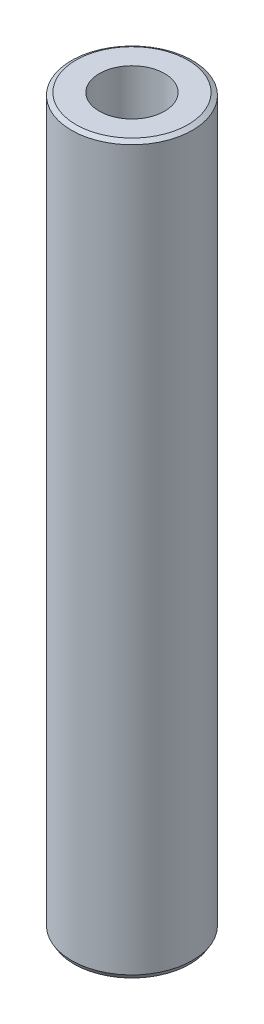
ISO-10303-21;
HEADER;
FILE_DESCRIPTION(('STEP AP214'),'2;1');
FILE_NAME('part.step','',(''),(''),'','','');
FILE_SCHEMA(('AUTOMOTIVE_DESIGN { 1 0 10303 214 1 1 1 1 }'));
ENDSEC;
DATA;
#1=APPLICATION_CONTEXT('core data for automotive mechanical design processes');
#2=APPLICATION_PROTOCOL_DEFINITION('international standard','automotive_design',2000,#1);
#3=PRODUCT_CONTEXT('',#1,'mechanical');
#4=PRODUCT('Part','Part','',(#3));
#5=PRODUCT_RELATED_PRODUCT_CATEGORY('part','',(#4));
#6=PRODUCT_DEFINITION_FORMATION('','',#4);
#7=PRODUCT_DEFINITION_CONTEXT('part definition',#1,'design');
#8=PRODUCT_DEFINITION('design','',#6,#7);
#9=PRODUCT_DEFINITION_SHAPE('','',#8);
#10=(LENGTH_UNIT() NAMED_UNIT(*) SI_UNIT(.MILLI.,.METRE.));
#11=(NAMED_UNIT(*) PLANE_ANGLE_UNIT() SI_UNIT($,.RADIAN.));
#12=(NAMED_UNIT(*) SI_UNIT($,.STERADIAN.) SOLID_ANGLE_UNIT());
#13=UNCERTAINTY_MEASURE_WITH_UNIT(LENGTH_MEASURE(1.E-05),#10,'distance_accuracy_value','');
#14=(GEOMETRIC_REPRESENTATION_CONTEXT(3) GLOBAL_UNCERTAINTY_ASSIGNED_CONTEXT((#13)) GLOBAL_UNIT_ASSIGNED_CONTEXT((#10,
#11,#12)) REPRESENTATION_CONTEXT('',''));
#15=CARTESIAN_POINT('',(0.,0.,0.));
#16=DIRECTION('',(0.,0.,1.));
#17=DIRECTION('',(1.,0.,0.));
#18=AXIS2_PLACEMENT_3D('',#15,#16,#17);
#19=CARTESIAN_POINT('',(0.,150.04970570346,0.));
#20=DIRECTION('',(0.,-1.,0.));
#21=DIRECTION('',(0.,0.,-1.));
#22=AXIS2_PLACEMENT_3D('',#19,#20,#21);
#23=CYLINDRICAL_SURFACE('',#22,12.5);
#24=CARTESIAN_POINT('',(0.,149.511906384868,0.));
#25=DIRECTION('',(0.,1.,0.));
#26=DIRECTION('',(0.,0.,1.));
#27=AXIS2_PLACEMENT_3D('',#24,#25,#26);
#28=CIRCLE('',#27,12.5);
#29=CARTESIAN_POINT('',(0.,149.511906384868,12.5));
#30=VERTEX_POINT('',#29);
#31=EDGE_CURVE('E50',#30,#30,#28,.F.);
#32=ORIENTED_EDGE('',*,*,#31,.T.);
#33=EDGE_LOOP('',(#32));
#34=FACE_BOUND('',#33,.T.);
#35=CARTESIAN_POINT('',(0.,0.931495744078664,0.));
#36=DIRECTION('',(0.,1.,0.));
#37=DIRECTION('',(0.,0.,1.));
#38=AXIS2_PLACEMENT_3D('',#35,#36,#37);
#39=CIRCLE('',#38,12.5);
#40=CARTESIAN_POINT('',(0.,0.931495744078664,12.5));
#41=VERTEX_POINT('',#40);
#42=EDGE_CURVE('E51',#41,#41,#39,.T.);
#43=ORIENTED_EDGE('',*,*,#42,.T.);
#44=EDGE_LOOP('',(#43));
#45=FACE_BOUND('',#44,.T.);
#46=ADVANCED_FACE('F39',(#34,#45),#23,.T.);
#47=CARTESIAN_POINT('',(0.,150.04970570346,0.));
#48=DIRECTION('',(0.,1.,0.));
#49=DIRECTION('',(0.,0.,1.));
#50=AXIS2_PLACEMENT_3D('',#47,#48,#49);
#51=PLANE('',#50);
#52=CARTESIAN_POINT('',(0.,150.04970570346,0.));
#53=DIRECTION('',(0.,1.,0.));
#54=DIRECTION('',(0.,0.,1.));
#55=AXIS2_PLACEMENT_3D('',#52,#53,#54);
#56=CIRCLE('',#55,11.5685042559213);
#57=CARTESIAN_POINT('',(0.,150.04970570346,11.5685042559213));
#58=VERTEX_POINT('',#57);
#59=EDGE_CURVE('E54',#58,#58,#56,.T.);
#60=ORIENTED_EDGE('',*,*,#59,.T.);
#61=EDGE_LOOP('',(#60));
#62=FACE_BOUND('',#61,.T.);
#63=CARTESIAN_POINT('',(0.,150.04970570346,0.));
#64=DIRECTION('',(0.,1.,0.));
#65=DIRECTION('',(0.,0.,1.));
#66=AXIS2_PLACEMENT_3D('',#63,#64,#65);
#67=CIRCLE('',#66,6.74713229035755);
#68=CARTESIAN_POINT('',(0.,150.04970570346,6.74713229035755));
#69=VERTEX_POINT('',#68);
#70=EDGE_CURVE('E58',#69,#69,#67,.T.);
#71=ORIENTED_EDGE('',*,*,#70,.F.);
#72=EDGE_LOOP('',(#71));
#73=FACE_BOUND('',#72,.T.);
#74=ADVANCED_FACE('F69',(#62,#73),#51,.T.);
#75=CARTESIAN_POINT('',(0.,0.,0.));
#76=DIRECTION('',(0.,1.,0.));
#77=DIRECTION('',(0.,0.,1.));
#78=AXIS2_PLACEMENT_3D('',#75,#76,#77);
#79=PLANE('',#78);
#80=CARTESIAN_POINT('',(0.,0.,0.));
#81=DIRECTION('',(0.,1.,0.));
#82=DIRECTION('',(0.,0.,1.));
#83=AXIS2_PLACEMENT_3D('',#80,#81,#82);
#84=CIRCLE('',#83,11.9622006814072);
#85=CARTESIAN_POINT('',(0.,0.,11.9622006814072));
#86=VERTEX_POINT('',#85);
#87=EDGE_CURVE('E10',#86,#86,#84,.F.);
#88=ORIENTED_EDGE('',*,*,#87,.T.);
#89=EDGE_LOOP('',(#88));
#90=FACE_BOUND('',#89,.T.);
#91=CARTESIAN_POINT('',(0.,0.,0.));
#92=DIRECTION('',(0.,1.,0.));
#93=DIRECTION('',(0.,0.,1.));
#94=AXIS2_PLACEMENT_3D('',#91,#92,#93);
#95=CIRCLE('',#94,6.74713229035755);
#96=CARTESIAN_POINT('',(0.,0.,6.74713229035755));
#97=VERTEX_POINT('',#96);
#98=EDGE_CURVE('E63',#97,#97,#95,.T.);
#99=ORIENTED_EDGE('',*,*,#98,.T.);
#100=EDGE_LOOP('',(#99));
#101=FACE_BOUND('',#100,.T.);
#102=ADVANCED_FACE('F75',(#90,#101),#79,.F.);
#103=CARTESIAN_POINT('',(0.,150.04970570346,0.));
#104=DIRECTION('',(0.,-1.,0.));
#105=DIRECTION('',(0.,0.,-1.));
#106=AXIS2_PLACEMENT_3D('',#103,#104,#105);
#107=CYLINDRICAL_SURFACE('',#106,6.74713229035755);
#108=ORIENTED_EDGE('',*,*,#70,.T.);
#109=EDGE_LOOP('',(#108));
#110=FACE_BOUND('',#109,.T.);
#111=ORIENTED_EDGE('',*,*,#98,.F.);
#112=EDGE_LOOP('',(#111));
#113=FACE_BOUND('',#112,.T.);
#114=ADVANCED_FACE('F70',(#110,#113),#107,.F.);
#115=CARTESIAN_POINT('',(0.,150.04970570346,0.));
#116=DIRECTION('',(0.,-1.,0.));
#117=DIRECTION('',(0.,0.,-1.));
#118=AXIS2_PLACEMENT_3D('',#115,#116,#117);
#119=CONICAL_SURFACE('',#118,11.5685042559213,1.0471975511966);
#120=ORIENTED_EDGE('',*,*,#31,.F.);
#121=EDGE_LOOP('',(#120));
#122=FACE_BOUND('',#121,.T.);
#123=ORIENTED_EDGE('',*,*,#59,.F.);
#124=EDGE_LOOP('',(#123));
#125=FACE_BOUND('',#124,.T.);
#126=ADVANCED_FACE('F81',(#122,#125),#119,.T.);
#127=CARTESIAN_POINT('',(0.,0.931495744078664,0.));
#128=DIRECTION('',(0.,1.,0.));
#129=DIRECTION('',(0.,0.,1.));
#130=AXIS2_PLACEMENT_3D('',#127,#128,#129);
#131=CONICAL_SURFACE('',#130,12.5,0.523598775598304);
#132=ORIENTED_EDGE('',*,*,#87,.F.);
#133=EDGE_LOOP('',(#132));
#134=FACE_BOUND('',#133,.T.);
#135=ORIENTED_EDGE('',*,*,#42,.F.);
#136=EDGE_LOOP('',(#135));
#137=FACE_BOUND('',#136,.T.);
#138=ADVANCED_FACE('F45',(#134,#137),#131,.T.);
#139=CLOSED_SHELL('',(#46,#74,#102,#114,#126,#138));
#140=MANIFOLD_SOLID_BREP('B2',#139);
#141=ADVANCED_BREP_SHAPE_REPRESENTATION('',(#18,#140),#14);
#142=SHAPE_DEFINITION_REPRESENTATION(#9,#141);
ENDSEC;
END-ISO-10303-21;
